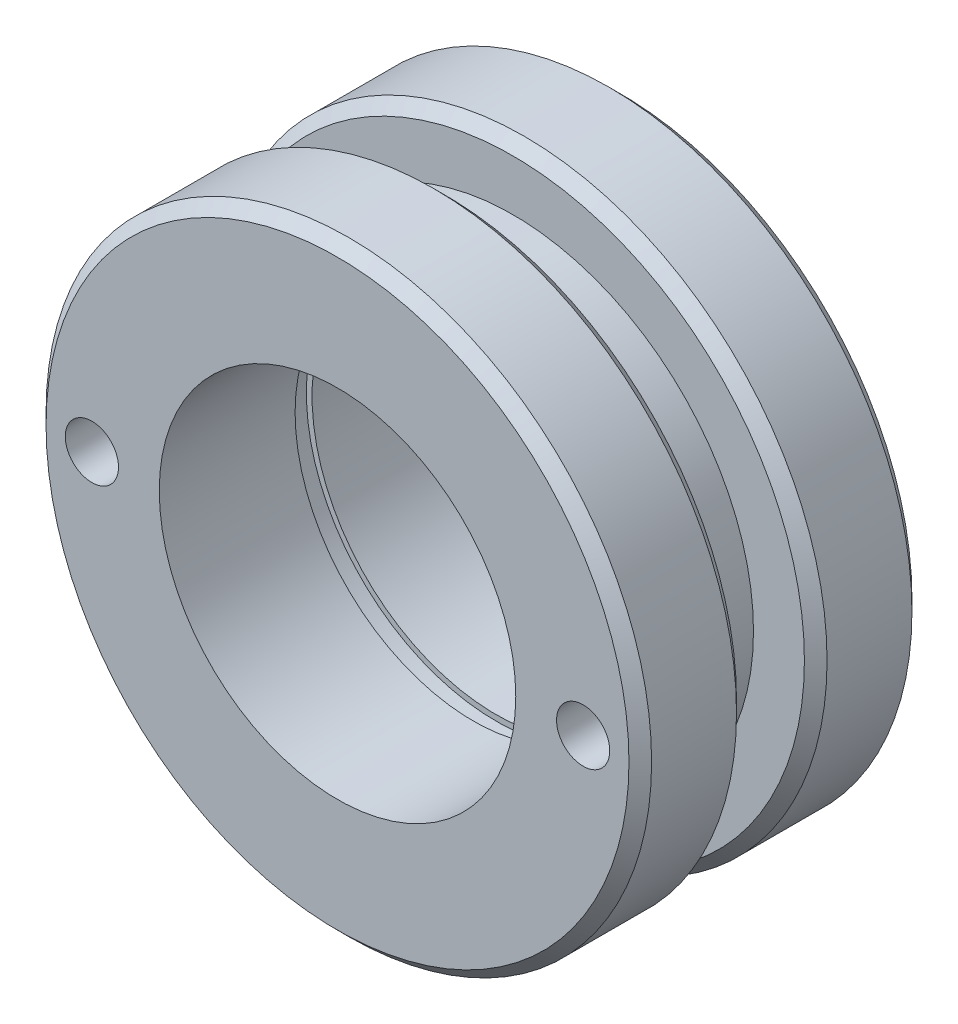
ISO-10303-21;
HEADER;
FILE_DESCRIPTION(('STEP AP214'),'2;1');
FILE_NAME('part.step','',(''),(''),'','','');
FILE_SCHEMA(('AUTOMOTIVE_DESIGN { 1 0 10303 214 1 1 1 1 }'));
ENDSEC;
DATA;
#1=APPLICATION_CONTEXT('core data for automotive mechanical design processes');
#2=APPLICATION_PROTOCOL_DEFINITION('international standard','automotive_design',2000,#1);
#3=PRODUCT_CONTEXT('',#1,'mechanical');
#4=PRODUCT('Part','Part','',(#3));
#5=PRODUCT_RELATED_PRODUCT_CATEGORY('part','',(#4));
#6=PRODUCT_DEFINITION_FORMATION('','',#4);
#7=PRODUCT_DEFINITION_CONTEXT('part definition',#1,'design');
#8=PRODUCT_DEFINITION('design','',#6,#7);
#9=PRODUCT_DEFINITION_SHAPE('','',#8);
#10=(LENGTH_UNIT() NAMED_UNIT(*) SI_UNIT(.MILLI.,.METRE.));
#11=(NAMED_UNIT(*) PLANE_ANGLE_UNIT() SI_UNIT($,.RADIAN.));
#12=(NAMED_UNIT(*) SI_UNIT($,.STERADIAN.) SOLID_ANGLE_UNIT());
#13=UNCERTAINTY_MEASURE_WITH_UNIT(LENGTH_MEASURE(1.E-05),#10,'distance_accuracy_value','');
#14=(GEOMETRIC_REPRESENTATION_CONTEXT(3) GLOBAL_UNCERTAINTY_ASSIGNED_CONTEXT((#13)) GLOBAL_UNIT_ASSIGNED_CONTEXT((#10,
#11,#12)) REPRESENTATION_CONTEXT('',''));
#15=CARTESIAN_POINT('',(0.,0.,0.));
#16=DIRECTION('',(0.,0.,1.));
#17=DIRECTION('',(1.,0.,0.));
#18=AXIS2_PLACEMENT_3D('',#15,#16,#17);
#19=CARTESIAN_POINT('',(0.,0.,6.35));
#20=DIRECTION('',(0.,0.,-1.));
#21=DIRECTION('',(-1.,0.,0.));
#22=AXIS2_PLACEMENT_3D('',#19,#20,#21);
#23=CYLINDRICAL_SURFACE('',#22,6.7945);
#24=CARTESIAN_POINT('',(0.,0.,0.254000000000003));
#25=DIRECTION('',(0.,0.,1.));
#26=DIRECTION('',(1.,0.,0.));
#27=AXIS2_PLACEMENT_3D('',#24,#25,#26);
#28=CIRCLE('',#27,6.7945);
#29=CARTESIAN_POINT('',(6.7945,0.,0.254000000000003));
#30=VERTEX_POINT('',#29);
#31=EDGE_CURVE('E29',#30,#30,#28,.T.);
#32=ORIENTED_EDGE('',*,*,#31,.T.);
#33=EDGE_LOOP('',(#32));
#34=FACE_BOUND('',#33,.T.);
#35=CARTESIAN_POINT('',(0.,0.,2.159));
#36=DIRECTION('',(0.,0.,1.));
#37=DIRECTION('',(1.,0.,0.));
#38=AXIS2_PLACEMENT_3D('',#35,#36,#37);
#39=CIRCLE('',#38,6.7945);
#40=CARTESIAN_POINT('',(6.7945,0.,2.159));
#41=VERTEX_POINT('',#40);
#42=EDGE_CURVE('E34',#41,#41,#39,.F.);
#43=ORIENTED_EDGE('',*,*,#42,.T.);
#44=EDGE_LOOP('',(#43));
#45=FACE_BOUND('',#44,.T.);
#46=ADVANCED_FACE('F14',(#34,#45),#23,.T.);
#47=CARTESIAN_POINT('',(0.,0.,4.191));
#48=DIRECTION('',(0.,0.,1.));
#49=DIRECTION('',(1.,0.,0.));
#50=AXIS2_PLACEMENT_3D('',#47,#48,#49);
#51=CIRCLE('',#50,6.7945);
#52=CARTESIAN_POINT('',(6.7945,0.,4.191));
#53=VERTEX_POINT('',#52);
#54=EDGE_CURVE('E40',#53,#53,#51,.T.);
#55=ORIENTED_EDGE('',*,*,#54,.T.);
#56=EDGE_LOOP('',(#55));
#57=FACE_BOUND('',#56,.T.);
#58=CARTESIAN_POINT('',(0.,0.,6.096));
#59=DIRECTION('',(0.,0.,1.));
#60=DIRECTION('',(1.,0.,0.));
#61=AXIS2_PLACEMENT_3D('',#58,#59,#60);
#62=CIRCLE('',#61,6.7945);
#63=CARTESIAN_POINT('',(6.7945,0.,6.096));
#64=VERTEX_POINT('',#63);
#65=EDGE_CURVE('E43',#64,#64,#62,.F.);
#66=ORIENTED_EDGE('',*,*,#65,.T.);
#67=EDGE_LOOP('',(#66));
#68=FACE_BOUND('',#67,.T.);
#69=ADVANCED_FACE('F150',(#57,#68),#23,.T.);
#70=CARTESIAN_POINT('',(0.,0.,6.35));
#71=DIRECTION('',(0.,0.,1.));
#72=DIRECTION('',(1.,0.,0.));
#73=AXIS2_PLACEMENT_3D('',#70,#71,#72);
#74=PLANE('',#73);
#75=CARTESIAN_POINT('',(0.,0.,6.35));
#76=DIRECTION('',(0.,0.,1.));
#77=DIRECTION('',(1.,0.,0.));
#78=AXIS2_PLACEMENT_3D('',#75,#76,#77);
#79=CIRCLE('',#78,6.5405);
#80=CARTESIAN_POINT('',(6.5405,0.,6.35));
#81=VERTEX_POINT('',#80);
#82=EDGE_CURVE('E10',#81,#81,#79,.T.);
#83=ORIENTED_EDGE('',*,*,#82,.T.);
#84=EDGE_LOOP('',(#83));
#85=FACE_BOUND('',#84,.T.);
#86=CARTESIAN_POINT('',(0.,0.,6.35));
#87=DIRECTION('',(0.,0.,1.));
#88=DIRECTION('',(1.,0.,0.));
#89=AXIS2_PLACEMENT_3D('',#86,#87,#88);
#90=CIRCLE('',#89,4.);
#91=CARTESIAN_POINT('',(4.,0.,6.35));
#92=VERTEX_POINT('',#91);
#93=EDGE_CURVE('E56',#92,#92,#90,.T.);
#94=ORIENTED_EDGE('',*,*,#93,.F.);
#95=EDGE_LOOP('',(#94));
#96=FACE_BOUND('',#95,.T.);
#97=CARTESIAN_POINT('',(5.5118,0.,6.35));
#98=DIRECTION('',(0.,0.,1.));
#99=DIRECTION('',(1.,0.,0.));
#100=AXIS2_PLACEMENT_3D('',#97,#98,#99);
#101=CIRCLE('',#100,0.5969);
#102=CARTESIAN_POINT('',(6.1087,0.,6.35));
#103=VERTEX_POINT('',#102);
#104=EDGE_CURVE('E53',#103,#103,#101,.T.);
#105=ORIENTED_EDGE('',*,*,#104,.F.);
#106=EDGE_LOOP('',(#105));
#107=FACE_BOUND('',#106,.T.);
#108=CARTESIAN_POINT('',(-5.5118,0.,6.35));
#109=DIRECTION('',(0.,0.,1.));
#110=DIRECTION('',(1.,0.,0.));
#111=AXIS2_PLACEMENT_3D('',#108,#109,#110);
#112=CIRCLE('',#111,0.5969);
#113=CARTESIAN_POINT('',(-4.9149,0.,6.35));
#114=VERTEX_POINT('',#113);
#115=EDGE_CURVE('E47',#114,#114,#112,.T.);
#116=ORIENTED_EDGE('',*,*,#115,.F.);
#117=EDGE_LOOP('',(#116));
#118=FACE_BOUND('',#117,.T.);
#119=ADVANCED_FACE('F108',(#85,#96,#107,#118),#74,.T.);
#120=CARTESIAN_POINT('',(0.,0.,0.));
#121=DIRECTION('',(0.,0.,1.));
#122=DIRECTION('',(1.,0.,0.));
#123=AXIS2_PLACEMENT_3D('',#120,#121,#122);
#124=PLANE('',#123);
#125=CARTESIAN_POINT('',(-5.5118,0.,0.));
#126=DIRECTION('',(0.,0.,-1.));
#127=DIRECTION('',(-1.,0.,0.));
#128=AXIS2_PLACEMENT_3D('',#125,#126,#127);
#129=CIRCLE('',#128,0.596900000000002);
#130=CARTESIAN_POINT('',(-6.1087,0.,0.));
#131=VERTEX_POINT('',#130);
#132=EDGE_CURVE('E89',#131,#131,#129,.T.);
#133=ORIENTED_EDGE('',*,*,#132,.F.);
#134=EDGE_LOOP('',(#133));
#135=FACE_BOUND('',#134,.T.);
#136=CARTESIAN_POINT('',(5.5118,0.,0.));
#137=DIRECTION('',(0.,0.,-1.));
#138=DIRECTION('',(-1.,0.,0.));
#139=AXIS2_PLACEMENT_3D('',#136,#137,#138);
#140=CIRCLE('',#139,0.596900000000002);
#141=CARTESIAN_POINT('',(4.9149,0.,0.));
#142=VERTEX_POINT('',#141);
#143=EDGE_CURVE('E83',#142,#142,#140,.T.);
#144=ORIENTED_EDGE('',*,*,#143,.F.);
#145=EDGE_LOOP('',(#144));
#146=FACE_BOUND('',#145,.T.);
#147=CARTESIAN_POINT('',(0.,0.,0.));
#148=DIRECTION('',(0.,0.,1.));
#149=DIRECTION('',(1.,0.,0.));
#150=AXIS2_PLACEMENT_3D('',#147,#148,#149);
#151=CIRCLE('',#150,6.5405);
#152=CARTESIAN_POINT('',(6.5405,0.,0.));
#153=VERTEX_POINT('',#152);
#154=EDGE_CURVE('E25',#153,#153,#151,.F.);
#155=ORIENTED_EDGE('',*,*,#154,.T.);
#156=EDGE_LOOP('',(#155));
#157=FACE_BOUND('',#156,.T.);
#158=CARTESIAN_POINT('',(0.,0.,0.));
#159=DIRECTION('',(0.,0.,1.));
#160=DIRECTION('',(1.,0.,0.));
#161=AXIS2_PLACEMENT_3D('',#158,#159,#160);
#162=CIRCLE('',#161,4.1275);
#163=CARTESIAN_POINT('',(4.1275,0.,0.));
#164=VERTEX_POINT('',#163);
#165=EDGE_CURVE('E68',#164,#164,#162,.T.);
#166=ORIENTED_EDGE('',*,*,#165,.T.);
#167=EDGE_LOOP('',(#166));
#168=FACE_BOUND('',#167,.T.);
#169=ADVANCED_FACE('F104',(#135,#146,#157,#168),#124,.F.);
#170=CARTESIAN_POINT('',(-5.5118,0.,4.826));
#171=DIRECTION('',(0.,0.,1.));
#172=DIRECTION('',(1.,0.,0.));
#173=AXIS2_PLACEMENT_3D('',#170,#171,#172);
#174=CYLINDRICAL_SURFACE('',#173,0.5969);
#175=CARTESIAN_POINT('',(-5.5118,0.,4.826));
#176=DIRECTION('',(0.,0.,1.));
#177=DIRECTION('',(1.,0.,0.));
#178=AXIS2_PLACEMENT_3D('',#175,#176,#177);
#179=CIRCLE('',#178,0.5969);
#180=CARTESIAN_POINT('',(-4.9149,0.,4.826));
#181=VERTEX_POINT('',#180);
#182=EDGE_CURVE('E46',#181,#181,#179,.T.);
#183=ORIENTED_EDGE('',*,*,#182,.F.);
#184=EDGE_LOOP('',(#183));
#185=FACE_BOUND('',#184,.T.);
#186=ORIENTED_EDGE('',*,*,#115,.T.);
#187=EDGE_LOOP('',(#186));
#188=FACE_BOUND('',#187,.T.);
#189=ADVANCED_FACE('F107',(#185,#188),#174,.F.);
#190=CARTESIAN_POINT('',(-5.5118,0.,4.826));
#191=DIRECTION('',(0.,0.,1.));
#192=DIRECTION('',(1.,0.,0.));
#193=AXIS2_PLACEMENT_3D('',#190,#191,#192);
#194=PLANE('',#193);
#195=ORIENTED_EDGE('',*,*,#182,.T.);
#196=EDGE_LOOP('',(#195));
#197=FACE_BOUND('',#196,.T.);
#198=ADVANCED_FACE('F157',(#197),#194,.T.);
#199=CARTESIAN_POINT('',(5.5118,0.,4.826));
#200=DIRECTION('',(0.,0.,1.));
#201=DIRECTION('',(1.,0.,0.));
#202=AXIS2_PLACEMENT_3D('',#199,#200,#201);
#203=CYLINDRICAL_SURFACE('',#202,0.5969);
#204=CARTESIAN_POINT('',(5.5118,0.,4.826));
#205=DIRECTION('',(0.,0.,1.));
#206=DIRECTION('',(1.,0.,0.));
#207=AXIS2_PLACEMENT_3D('',#204,#205,#206);
#208=CIRCLE('',#207,0.5969);
#209=CARTESIAN_POINT('',(6.1087,0.,4.826));
#210=VERTEX_POINT('',#209);
#211=EDGE_CURVE('E50',#210,#210,#208,.T.);
#212=ORIENTED_EDGE('',*,*,#211,.F.);
#213=EDGE_LOOP('',(#212));
#214=FACE_BOUND('',#213,.T.);
#215=ORIENTED_EDGE('',*,*,#104,.T.);
#216=EDGE_LOOP('',(#215));
#217=FACE_BOUND('',#216,.T.);
#218=ADVANCED_FACE('F165',(#214,#217),#203,.F.);
#219=CARTESIAN_POINT('',(5.5118,0.,4.826));
#220=DIRECTION('',(0.,0.,1.));
#221=DIRECTION('',(1.,0.,0.));
#222=AXIS2_PLACEMENT_3D('',#219,#220,#221);
#223=PLANE('',#222);
#224=ORIENTED_EDGE('',*,*,#211,.T.);
#225=EDGE_LOOP('',(#224));
#226=FACE_BOUND('',#225,.T.);
#227=ADVANCED_FACE('F144',(#226),#223,.T.);
#228=CARTESIAN_POINT('',(0.,0.,3.302));
#229=DIRECTION('',(0.,0.,1.));
#230=DIRECTION('',(1.,0.,0.));
#231=AXIS2_PLACEMENT_3D('',#228,#229,#230);
#232=CYLINDRICAL_SURFACE('',#231,4.);
#233=CARTESIAN_POINT('',(0.,0.,3.302));
#234=DIRECTION('',(0.,0.,1.));
#235=DIRECTION('',(1.,0.,0.));
#236=AXIS2_PLACEMENT_3D('',#233,#234,#235);
#237=CIRCLE('',#236,4.);
#238=CARTESIAN_POINT('',(4.,0.,3.302));
#239=VERTEX_POINT('',#238);
#240=EDGE_CURVE('E61',#239,#239,#237,.F.);
#241=ORIENTED_EDGE('',*,*,#240,.T.);
#242=EDGE_LOOP('',(#241));
#243=FACE_BOUND('',#242,.T.);
#244=ORIENTED_EDGE('',*,*,#93,.T.);
#245=EDGE_LOOP('',(#244));
#246=FACE_BOUND('',#245,.T.);
#247=ADVANCED_FACE('F138',(#243,#246),#232,.F.);
#248=CARTESIAN_POINT('',(0.,0.,3.302));
#249=DIRECTION('',(0.,0.,1.));
#250=DIRECTION('',(1.,0.,0.));
#251=AXIS2_PLACEMENT_3D('',#248,#249,#250);
#252=PLANE('',#251);
#253=CARTESIAN_POINT('',(0.,0.,3.302));
#254=DIRECTION('',(0.,0.,1.));
#255=DIRECTION('',(1.,0.,0.));
#256=AXIS2_PLACEMENT_3D('',#253,#254,#255);
#257=CIRCLE('',#256,4.2545);
#258=CARTESIAN_POINT('',(4.2545,0.,3.302));
#259=VERTEX_POINT('',#258);
#260=EDGE_CURVE('E65',#259,#259,#257,.T.);
#261=ORIENTED_EDGE('',*,*,#260,.F.);
#262=EDGE_LOOP('',(#261));
#263=FACE_BOUND('',#262,.T.);
#264=ORIENTED_EDGE('',*,*,#240,.F.);
#265=EDGE_LOOP('',(#264));
#266=FACE_BOUND('',#265,.T.);
#267=ADVANCED_FACE('F132',(#263,#266),#252,.F.);
#268=CARTESIAN_POINT('',(0.,0.,2.794));
#269=DIRECTION('',(0.,0.,1.));
#270=DIRECTION('',(1.,0.,0.));
#271=AXIS2_PLACEMENT_3D('',#268,#269,#270);
#272=CYLINDRICAL_SURFACE('',#271,4.2545);
#273=CARTESIAN_POINT('',(0.,0.,2.794));
#274=DIRECTION('',(0.,0.,1.));
#275=DIRECTION('',(1.,0.,0.));
#276=AXIS2_PLACEMENT_3D('',#273,#274,#275);
#277=CIRCLE('',#276,4.2545);
#278=CARTESIAN_POINT('',(4.2545,0.,2.794));
#279=VERTEX_POINT('',#278);
#280=EDGE_CURVE('E64',#279,#279,#277,.T.);
#281=ORIENTED_EDGE('',*,*,#280,.F.);
#282=EDGE_LOOP('',(#281));
#283=FACE_BOUND('',#282,.T.);
#284=ORIENTED_EDGE('',*,*,#260,.T.);
#285=EDGE_LOOP('',(#284));
#286=FACE_BOUND('',#285,.T.);
#287=ADVANCED_FACE('F126',(#283,#286),#272,.F.);
#288=CARTESIAN_POINT('',(0.,0.,2.794));
#289=DIRECTION('',(0.,0.,1.));
#290=DIRECTION('',(1.,0.,0.));
#291=AXIS2_PLACEMENT_3D('',#288,#289,#290);
#292=PLANE('',#291);
#293=CARTESIAN_POINT('',(0.,0.,2.794));
#294=DIRECTION('',(0.,0.,1.));
#295=DIRECTION('',(1.,0.,0.));
#296=AXIS2_PLACEMENT_3D('',#293,#294,#295);
#297=CIRCLE('',#296,4.1275);
#298=CARTESIAN_POINT('',(4.1275,0.,2.794));
#299=VERTEX_POINT('',#298);
#300=EDGE_CURVE('E71',#299,#299,#297,.T.);
#301=ORIENTED_EDGE('',*,*,#300,.F.);
#302=EDGE_LOOP('',(#301));
#303=FACE_BOUND('',#302,.T.);
#304=ORIENTED_EDGE('',*,*,#280,.T.);
#305=EDGE_LOOP('',(#304));
#306=FACE_BOUND('',#305,.T.);
#307=ADVANCED_FACE('F120',(#303,#306),#292,.T.);
#308=CARTESIAN_POINT('',(0.,0.,0.));
#309=DIRECTION('',(0.,0.,1.));
#310=DIRECTION('',(1.,0.,0.));
#311=AXIS2_PLACEMENT_3D('',#308,#309,#310);
#312=CYLINDRICAL_SURFACE('',#311,4.1275);
#313=ORIENTED_EDGE('',*,*,#165,.F.);
#314=EDGE_LOOP('',(#313));
#315=FACE_BOUND('',#314,.T.);
#316=ORIENTED_EDGE('',*,*,#300,.T.);
#317=EDGE_LOOP('',(#316));
#318=FACE_BOUND('',#317,.T.);
#319=ADVANCED_FACE('F116',(#315,#318),#312,.F.);
#320=CARTESIAN_POINT('',(0.,0.,3.937));
#321=DIRECTION('',(0.,0.,1.));
#322=DIRECTION('',(1.,0.,0.));
#323=AXIS2_PLACEMENT_3D('',#320,#321,#322);
#324=PLANE('',#323);
#325=CARTESIAN_POINT('',(0.,0.,3.937));
#326=DIRECTION('',(0.,0.,1.));
#327=DIRECTION('',(1.,0.,0.));
#328=AXIS2_PLACEMENT_3D('',#325,#326,#327);
#329=CIRCLE('',#328,6.5405);
#330=CARTESIAN_POINT('',(6.5405,0.,3.937));
#331=VERTEX_POINT('',#330);
#332=EDGE_CURVE('E37',#331,#331,#329,.F.);
#333=ORIENTED_EDGE('',*,*,#332,.T.);
#334=EDGE_LOOP('',(#333));
#335=FACE_BOUND('',#334,.T.);
#336=CARTESIAN_POINT('',(0.,0.,3.937));
#337=DIRECTION('',(0.,0.,1.));
#338=DIRECTION('',(1.,0.,0.));
#339=AXIS2_PLACEMENT_3D('',#336,#337,#338);
#340=CIRCLE('',#339,5.3975);
#341=CARTESIAN_POINT('',(5.3975,0.,3.937));
#342=VERTEX_POINT('',#341);
#343=EDGE_CURVE('E74',#342,#342,#340,.T.);
#344=ORIENTED_EDGE('',*,*,#343,.T.);
#345=EDGE_LOOP('',(#344));
#346=FACE_BOUND('',#345,.T.);
#347=ADVANCED_FACE('F119',(#335,#346),#324,.F.);
#348=CARTESIAN_POINT('',(0.,0.,2.413));
#349=DIRECTION('',(0.,0.,1.));
#350=DIRECTION('',(1.,0.,0.));
#351=AXIS2_PLACEMENT_3D('',#348,#349,#350);
#352=PLANE('',#351);
#353=CARTESIAN_POINT('',(0.,0.,2.413));
#354=DIRECTION('',(0.,0.,1.));
#355=DIRECTION('',(1.,0.,0.));
#356=AXIS2_PLACEMENT_3D('',#353,#354,#355);
#357=CIRCLE('',#356,6.5405);
#358=CARTESIAN_POINT('',(6.5405,0.,2.413));
#359=VERTEX_POINT('',#358);
#360=EDGE_CURVE('E21',#359,#359,#357,.T.);
#361=ORIENTED_EDGE('',*,*,#360,.T.);
#362=EDGE_LOOP('',(#361));
#363=FACE_BOUND('',#362,.T.);
#364=CARTESIAN_POINT('',(0.,0.,2.413));
#365=DIRECTION('',(0.,0.,1.));
#366=DIRECTION('',(1.,0.,0.));
#367=AXIS2_PLACEMENT_3D('',#364,#365,#366);
#368=CIRCLE('',#367,5.3975);
#369=CARTESIAN_POINT('',(5.3975,0.,2.413));
#370=VERTEX_POINT('',#369);
#371=EDGE_CURVE('E77',#370,#370,#368,.T.);
#372=ORIENTED_EDGE('',*,*,#371,.F.);
#373=EDGE_LOOP('',(#372));
#374=FACE_BOUND('',#373,.T.);
#375=ADVANCED_FACE('F219',(#363,#374),#352,.T.);
#376=CARTESIAN_POINT('',(0.,0.,3.937));
#377=DIRECTION('',(0.,0.,-1.));
#378=DIRECTION('',(-1.,0.,0.));
#379=AXIS2_PLACEMENT_3D('',#376,#377,#378);
#380=CYLINDRICAL_SURFACE('',#379,5.3975);
#381=ORIENTED_EDGE('',*,*,#343,.F.);
#382=EDGE_LOOP('',(#381));
#383=FACE_BOUND('',#382,.T.);
#384=ORIENTED_EDGE('',*,*,#371,.T.);
#385=EDGE_LOOP('',(#384));
#386=FACE_BOUND('',#385,.T.);
#387=ADVANCED_FACE('F184',(#383,#386),#380,.T.);
#388=CARTESIAN_POINT('',(0.,0.,4.191));
#389=DIRECTION('',(0.,0.,1.));
#390=DIRECTION('',(1.,0.,0.));
#391=AXIS2_PLACEMENT_3D('',#388,#389,#390);
#392=CONICAL_SURFACE('',#391,6.7945,0.785398163397448);
#393=ORIENTED_EDGE('',*,*,#332,.F.);
#394=EDGE_LOOP('',(#393));
#395=FACE_BOUND('',#394,.T.);
#396=ORIENTED_EDGE('',*,*,#54,.F.);
#397=EDGE_LOOP('',(#396));
#398=FACE_BOUND('',#397,.T.);
#399=ADVANCED_FACE('F180',(#395,#398),#392,.T.);
#400=CARTESIAN_POINT('',(0.,0.,0.254000000000003));
#401=DIRECTION('',(0.,0.,1.));
#402=DIRECTION('',(1.,0.,0.));
#403=AXIS2_PLACEMENT_3D('',#400,#401,#402);
#404=CONICAL_SURFACE('',#403,6.7945,0.785398163397448);
#405=ORIENTED_EDGE('',*,*,#154,.F.);
#406=EDGE_LOOP('',(#405));
#407=FACE_BOUND('',#406,.T.);
#408=ORIENTED_EDGE('',*,*,#31,.F.);
#409=EDGE_LOOP('',(#408));
#410=FACE_BOUND('',#409,.T.);
#411=ADVANCED_FACE('F183',(#407,#410),#404,.T.);
#412=CARTESIAN_POINT('',(0.,0.,2.413));
#413=DIRECTION('',(0.,0.,-1.));
#414=DIRECTION('',(-1.,0.,0.));
#415=AXIS2_PLACEMENT_3D('',#412,#413,#414);
#416=CONICAL_SURFACE('',#415,6.5405,0.785398163397448);
#417=ORIENTED_EDGE('',*,*,#42,.F.);
#418=EDGE_LOOP('',(#417));
#419=FACE_BOUND('',#418,.T.);
#420=ORIENTED_EDGE('',*,*,#360,.F.);
#421=EDGE_LOOP('',(#420));
#422=FACE_BOUND('',#421,.T.);
#423=ADVANCED_FACE('F187',(#419,#422),#416,.T.);
#424=CARTESIAN_POINT('',(0.,0.,6.35));
#425=DIRECTION('',(0.,0.,-1.));
#426=DIRECTION('',(-1.,0.,0.));
#427=AXIS2_PLACEMENT_3D('',#424,#425,#426);
#428=CONICAL_SURFACE('',#427,6.5405,0.785398163397448);
#429=ORIENTED_EDGE('',*,*,#65,.F.);
#430=EDGE_LOOP('',(#429));
#431=FACE_BOUND('',#430,.T.);
#432=ORIENTED_EDGE('',*,*,#82,.F.);
#433=EDGE_LOOP('',(#432));
#434=FACE_BOUND('',#433,.T.);
#435=ADVANCED_FACE('F16',(#431,#434),#428,.T.);
#436=CARTESIAN_POINT('',(5.5118,0.,1.524));
#437=DIRECTION('',(0.,0.,-1.));
#438=DIRECTION('',(-1.,0.,0.));
#439=AXIS2_PLACEMENT_3D('',#436,#437,#438);
#440=CYLINDRICAL_SURFACE('',#439,0.596900000000002);
#441=CARTESIAN_POINT('',(5.5118,0.,1.524));
#442=DIRECTION('',(0.,0.,-1.));
#443=DIRECTION('',(-1.,0.,0.));
#444=AXIS2_PLACEMENT_3D('',#441,#442,#443);
#445=CIRCLE('',#444,0.596900000000002);
#446=CARTESIAN_POINT('',(4.9149,0.,1.524));
#447=VERTEX_POINT('',#446);
#448=EDGE_CURVE('E80',#447,#447,#445,.T.);
#449=ORIENTED_EDGE('',*,*,#448,.F.);
#450=EDGE_LOOP('',(#449));
#451=FACE_BOUND('',#450,.T.);
#452=ORIENTED_EDGE('',*,*,#143,.T.);
#453=EDGE_LOOP('',(#452));
#454=FACE_BOUND('',#453,.T.);
#455=ADVANCED_FACE('F195',(#451,#454),#440,.F.);
#456=CARTESIAN_POINT('',(5.5118,0.,1.524));
#457=DIRECTION('',(0.,0.,-1.));
#458=DIRECTION('',(-1.,0.,0.));
#459=AXIS2_PLACEMENT_3D('',#456,#457,#458);
#460=PLANE('',#459);
#461=ORIENTED_EDGE('',*,*,#448,.T.);
#462=EDGE_LOOP('',(#461));
#463=FACE_BOUND('',#462,.T.);
#464=ADVANCED_FACE('F100',(#463),#460,.T.);
#465=CARTESIAN_POINT('',(-5.5118,0.,1.524));
#466=DIRECTION('',(0.,0.,-1.));
#467=DIRECTION('',(-1.,0.,0.));
#468=AXIS2_PLACEMENT_3D('',#465,#466,#467);
#469=CYLINDRICAL_SURFACE('',#468,0.596900000000002);
#470=CARTESIAN_POINT('',(-5.5118,0.,1.524));
#471=DIRECTION('',(0.,0.,-1.));
#472=DIRECTION('',(-1.,0.,0.));
#473=AXIS2_PLACEMENT_3D('',#470,#471,#472);
#474=CIRCLE('',#473,0.596900000000002);
#475=CARTESIAN_POINT('',(-6.1087,0.,1.524));
#476=VERTEX_POINT('',#475);
#477=EDGE_CURVE('E86',#476,#476,#474,.T.);
#478=ORIENTED_EDGE('',*,*,#477,.F.);
#479=EDGE_LOOP('',(#478));
#480=FACE_BOUND('',#479,.T.);
#481=ORIENTED_EDGE('',*,*,#132,.T.);
#482=EDGE_LOOP('',(#481));
#483=FACE_BOUND('',#482,.T.);
#484=ADVANCED_FACE('F97',(#480,#483),#469,.F.);
#485=CARTESIAN_POINT('',(-5.5118,0.,1.524));
#486=DIRECTION('',(0.,0.,-1.));
#487=DIRECTION('',(-1.,0.,0.));
#488=AXIS2_PLACEMENT_3D('',#485,#486,#487);
#489=PLANE('',#488);
#490=ORIENTED_EDGE('',*,*,#477,.T.);
#491=EDGE_LOOP('',(#490));
#492=FACE_BOUND('',#491,.T.);
#493=ADVANCED_FACE('F95',(#492),#489,.T.);
#494=CLOSED_SHELL('',(#46,#69,#119,#169,#189,#198,#218,#227,#247,#267,#287,#307,#319,#347,#375,
#387,#399,#411,#423,#435,#455,#464,#484,#493));
#495=MANIFOLD_SOLID_BREP('B1',#494);
#496=ADVANCED_BREP_SHAPE_REPRESENTATION('',(#18,#495),#14);
#497=SHAPE_DEFINITION_REPRESENTATION(#9,#496);
ENDSEC;
END-ISO-10303-21;
